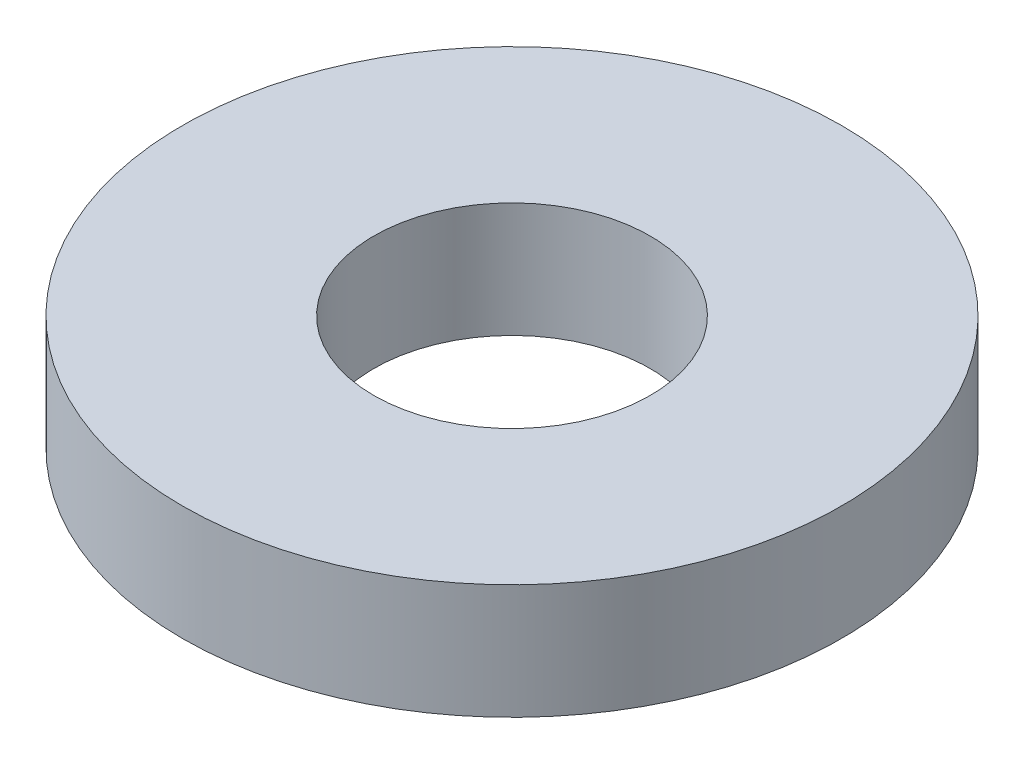
ISO-10303-21;
HEADER;
FILE_DESCRIPTION(('STEP AP214'),'2;1');
FILE_NAME('part.step','',(''),(''),'','','');
FILE_SCHEMA(('AUTOMOTIVE_DESIGN { 1 0 10303 214 1 1 1 1 }'));
ENDSEC;
DATA;
#1=APPLICATION_CONTEXT('core data for automotive mechanical design processes');
#2=APPLICATION_PROTOCOL_DEFINITION('international standard','automotive_design',2000,#1);
#3=PRODUCT_CONTEXT('',#1,'mechanical');
#4=PRODUCT('Part','Part','',(#3));
#5=PRODUCT_RELATED_PRODUCT_CATEGORY('part','',(#4));
#6=PRODUCT_DEFINITION_FORMATION('','',#4);
#7=PRODUCT_DEFINITION_CONTEXT('part definition',#1,'design');
#8=PRODUCT_DEFINITION('design','',#6,#7);
#9=PRODUCT_DEFINITION_SHAPE('','',#8);
#10=(LENGTH_UNIT() NAMED_UNIT(*) SI_UNIT(.MILLI.,.METRE.));
#11=(NAMED_UNIT(*) PLANE_ANGLE_UNIT() SI_UNIT($,.RADIAN.));
#12=(NAMED_UNIT(*) SI_UNIT($,.STERADIAN.) SOLID_ANGLE_UNIT());
#13=UNCERTAINTY_MEASURE_WITH_UNIT(LENGTH_MEASURE(1.E-05),#10,'distance_accuracy_value','');
#14=(GEOMETRIC_REPRESENTATION_CONTEXT(3) GLOBAL_UNCERTAINTY_ASSIGNED_CONTEXT((#13)) GLOBAL_UNIT_ASSIGNED_CONTEXT((#10,
#11,#12)) REPRESENTATION_CONTEXT('',''));
#15=CARTESIAN_POINT('',(0.,0.,0.));
#16=DIRECTION('',(0.,0.,1.));
#17=DIRECTION('',(1.,0.,0.));
#18=AXIS2_PLACEMENT_3D('',#15,#16,#17);
#19=CARTESIAN_POINT('',(0.,27.,0.));
#20=DIRECTION('',(0.,-1.,0.));
#21=DIRECTION('',(0.,0.,-1.));
#22=AXIS2_PLACEMENT_3D('',#19,#20,#21);
#23=CYLINDRICAL_SURFACE('',#22,77.5);
#24=CARTESIAN_POINT('',(0.,27.,0.));
#25=DIRECTION('',(0.,1.,0.));
#26=DIRECTION('',(0.,0.,1.));
#27=AXIS2_PLACEMENT_3D('',#24,#25,#26);
#28=CIRCLE('',#27,77.5);
#29=CARTESIAN_POINT('',(0.,27.,77.5));
#30=VERTEX_POINT('',#29);
#31=EDGE_CURVE('E10',#30,#30,#28,.T.);
#32=ORIENTED_EDGE('',*,*,#31,.F.);
#33=EDGE_LOOP('',(#32));
#34=FACE_BOUND('',#33,.T.);
#35=CARTESIAN_POINT('',(0.,0.,0.));
#36=DIRECTION('',(0.,1.,0.));
#37=DIRECTION('',(0.,0.,1.));
#38=AXIS2_PLACEMENT_3D('',#35,#36,#37);
#39=CIRCLE('',#38,77.5);
#40=CARTESIAN_POINT('',(0.,0.,77.5));
#41=VERTEX_POINT('',#40);
#42=EDGE_CURVE('E37',#41,#41,#39,.T.);
#43=ORIENTED_EDGE('',*,*,#42,.T.);
#44=EDGE_LOOP('',(#43));
#45=FACE_BOUND('',#44,.T.);
#46=ADVANCED_FACE('F40',(#34,#45),#23,.T.);
#47=CARTESIAN_POINT('',(0.,27.,0.));
#48=DIRECTION('',(0.,1.,0.));
#49=DIRECTION('',(0.,0.,1.));
#50=AXIS2_PLACEMENT_3D('',#47,#48,#49);
#51=PLANE('',#50);
#52=CARTESIAN_POINT('',(0.,27.,0.));
#53=DIRECTION('',(0.,1.,0.));
#54=DIRECTION('',(0.,0.,1.));
#55=AXIS2_PLACEMENT_3D('',#52,#53,#54);
#56=CIRCLE('',#55,32.5);
#57=CARTESIAN_POINT('',(0.,27.,32.5));
#58=VERTEX_POINT('',#57);
#59=EDGE_CURVE('E50',#58,#58,#56,.T.);
#60=ORIENTED_EDGE('',*,*,#59,.F.);
#61=EDGE_LOOP('',(#60));
#62=FACE_BOUND('',#61,.T.);
#63=ORIENTED_EDGE('',*,*,#31,.T.);
#64=EDGE_LOOP('',(#63));
#65=FACE_BOUND('',#64,.T.);
#66=ADVANCED_FACE('F59',(#62,#65),#51,.T.);
#67=CARTESIAN_POINT('',(0.,0.,0.));
#68=DIRECTION('',(0.,1.,0.));
#69=DIRECTION('',(0.,0.,1.));
#70=AXIS2_PLACEMENT_3D('',#67,#68,#69);
#71=PLANE('',#70);
#72=CARTESIAN_POINT('',(0.,0.,0.));
#73=DIRECTION('',(0.,1.,0.));
#74=DIRECTION('',(0.,0.,1.));
#75=AXIS2_PLACEMENT_3D('',#72,#73,#74);
#76=CIRCLE('',#75,32.5);
#77=CARTESIAN_POINT('',(0.,0.,32.5));
#78=VERTEX_POINT('',#77);
#79=EDGE_CURVE('E47',#78,#78,#76,.T.);
#80=ORIENTED_EDGE('',*,*,#79,.T.);
#81=EDGE_LOOP('',(#80));
#82=FACE_BOUND('',#81,.T.);
#83=ORIENTED_EDGE('',*,*,#42,.F.);
#84=EDGE_LOOP('',(#83));
#85=FACE_BOUND('',#84,.T.);
#86=ADVANCED_FACE('F58',(#82,#85),#71,.F.);
#87=CARTESIAN_POINT('',(0.,27.,0.));
#88=DIRECTION('',(0.,-1.,0.));
#89=DIRECTION('',(0.,0.,-1.));
#90=AXIS2_PLACEMENT_3D('',#87,#88,#89);
#91=CYLINDRICAL_SURFACE('',#90,32.5);
#92=ORIENTED_EDGE('',*,*,#59,.T.);
#93=EDGE_LOOP('',(#92));
#94=FACE_BOUND('',#93,.T.);
#95=ORIENTED_EDGE('',*,*,#79,.F.);
#96=EDGE_LOOP('',(#95));
#97=FACE_BOUND('',#96,.T.);
#98=ADVANCED_FACE('F54',(#94,#97),#91,.F.);
#99=CLOSED_SHELL('',(#46,#66,#86,#98));
#100=MANIFOLD_SOLID_BREP('B2',#99);
#101=ADVANCED_BREP_SHAPE_REPRESENTATION('',(#18,#100),#14);
#102=SHAPE_DEFINITION_REPRESENTATION(#9,#101);
ENDSEC;
END-ISO-10303-21;
